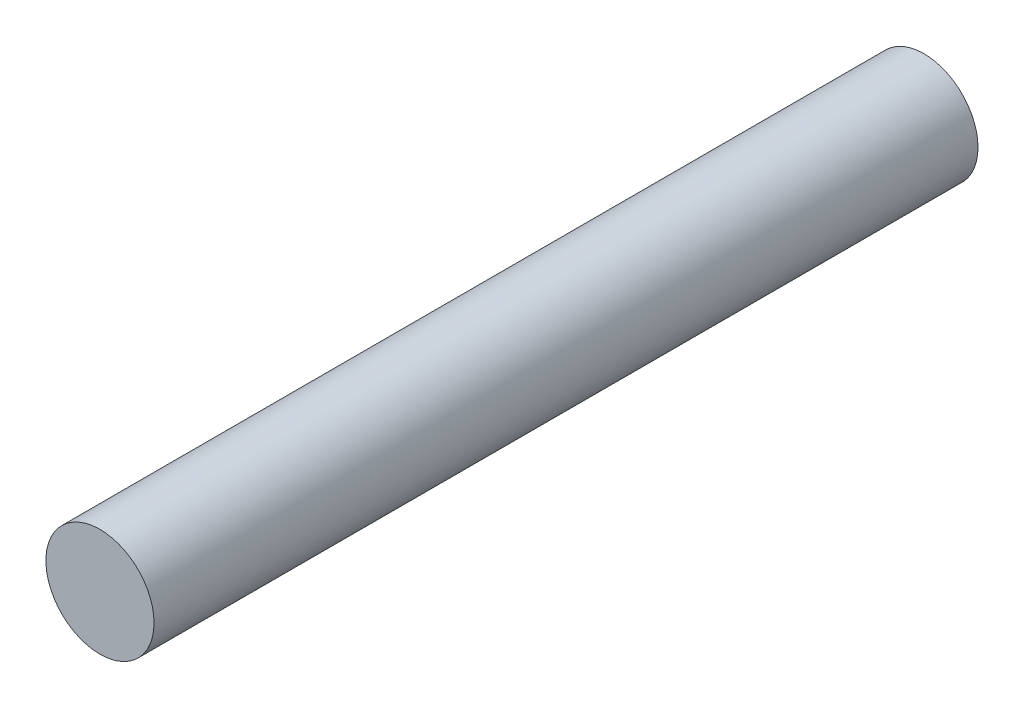
ISO-10303-21;
HEADER;
FILE_DESCRIPTION(('STEP AP214'),'2;1');
FILE_NAME('part.step','',(''),(''),'','','');
FILE_SCHEMA(('AUTOMOTIVE_DESIGN { 1 0 10303 214 1 1 1 1 }'));
ENDSEC;
DATA;
#1=APPLICATION_CONTEXT('core data for automotive mechanical design processes');
#2=APPLICATION_PROTOCOL_DEFINITION('international standard','automotive_design',2000,#1);
#3=PRODUCT_CONTEXT('',#1,'mechanical');
#4=PRODUCT('Part','Part','',(#3));
#5=PRODUCT_RELATED_PRODUCT_CATEGORY('part','',(#4));
#6=PRODUCT_DEFINITION_FORMATION('','',#4);
#7=PRODUCT_DEFINITION_CONTEXT('part definition',#1,'design');
#8=PRODUCT_DEFINITION('design','',#6,#7);
#9=PRODUCT_DEFINITION_SHAPE('','',#8);
#10=(LENGTH_UNIT() NAMED_UNIT(*) SI_UNIT(.MILLI.,.METRE.));
#11=(NAMED_UNIT(*) PLANE_ANGLE_UNIT() SI_UNIT($,.RADIAN.));
#12=(NAMED_UNIT(*) SI_UNIT($,.STERADIAN.) SOLID_ANGLE_UNIT());
#13=UNCERTAINTY_MEASURE_WITH_UNIT(LENGTH_MEASURE(1.E-05),#10,'distance_accuracy_value','');
#14=(GEOMETRIC_REPRESENTATION_CONTEXT(3) GLOBAL_UNCERTAINTY_ASSIGNED_CONTEXT((#13)) GLOBAL_UNIT_ASSIGNED_CONTEXT((#10,
#11,#12)) REPRESENTATION_CONTEXT('',''));
#15=CARTESIAN_POINT('',(0.,0.,0.));
#16=DIRECTION('',(0.,0.,1.));
#17=DIRECTION('',(1.,0.,0.));
#18=AXIS2_PLACEMENT_3D('',#15,#16,#17);
#19=CARTESIAN_POINT('',(0.,0.,19.05));
#20=DIRECTION('',(0.,0.,-1.));
#21=DIRECTION('',(-1.,0.,0.));
#22=AXIS2_PLACEMENT_3D('',#19,#20,#21);
#23=CYLINDRICAL_SURFACE('',#22,2.5);
#24=CARTESIAN_POINT('',(0.,0.,19.05));
#25=DIRECTION('',(0.,0.,1.));
#26=DIRECTION('',(1.,0.,0.));
#27=AXIS2_PLACEMENT_3D('',#24,#25,#26);
#28=CIRCLE('',#27,2.5);
#29=CARTESIAN_POINT('',(2.5,0.,19.05));
#30=VERTEX_POINT('',#29);
#31=EDGE_CURVE('E10',#30,#30,#28,.T.);
#32=ORIENTED_EDGE('',*,*,#31,.F.);
#33=EDGE_LOOP('',(#32));
#34=FACE_BOUND('',#33,.T.);
#35=CARTESIAN_POINT('',(0.,0.,-19.05));
#36=DIRECTION('',(0.,0.,1.));
#37=DIRECTION('',(1.,0.,0.));
#38=AXIS2_PLACEMENT_3D('',#35,#36,#37);
#39=CIRCLE('',#38,2.5);
#40=CARTESIAN_POINT('',(2.5,0.,-19.05));
#41=VERTEX_POINT('',#40);
#42=EDGE_CURVE('E34',#41,#41,#39,.T.);
#43=ORIENTED_EDGE('',*,*,#42,.T.);
#44=EDGE_LOOP('',(#43));
#45=FACE_BOUND('',#44,.T.);
#46=ADVANCED_FACE('F31',(#34,#45),#23,.T.);
#47=CARTESIAN_POINT('',(0.,0.,19.05));
#48=DIRECTION('',(0.,0.,1.));
#49=DIRECTION('',(1.,0.,0.));
#50=AXIS2_PLACEMENT_3D('',#47,#48,#49);
#51=PLANE('',#50);
#52=ORIENTED_EDGE('',*,*,#31,.T.);
#53=EDGE_LOOP('',(#52));
#54=FACE_BOUND('',#53,.T.);
#55=ADVANCED_FACE('F46',(#54),#51,.T.);
#56=CARTESIAN_POINT('',(0.,0.,-19.05));
#57=DIRECTION('',(0.,0.,1.));
#58=DIRECTION('',(1.,0.,0.));
#59=AXIS2_PLACEMENT_3D('',#56,#57,#58);
#60=PLANE('',#59);
#61=ORIENTED_EDGE('',*,*,#42,.F.);
#62=EDGE_LOOP('',(#61));
#63=FACE_BOUND('',#62,.T.);
#64=ADVANCED_FACE('F44',(#63),#60,.F.);
#65=CLOSED_SHELL('',(#46,#55,#64));
#66=MANIFOLD_SOLID_BREP('B2',#65);
#67=ADVANCED_BREP_SHAPE_REPRESENTATION('',(#18,#66),#14);
#68=SHAPE_DEFINITION_REPRESENTATION(#9,#67);
ENDSEC;
END-ISO-10303-21;
